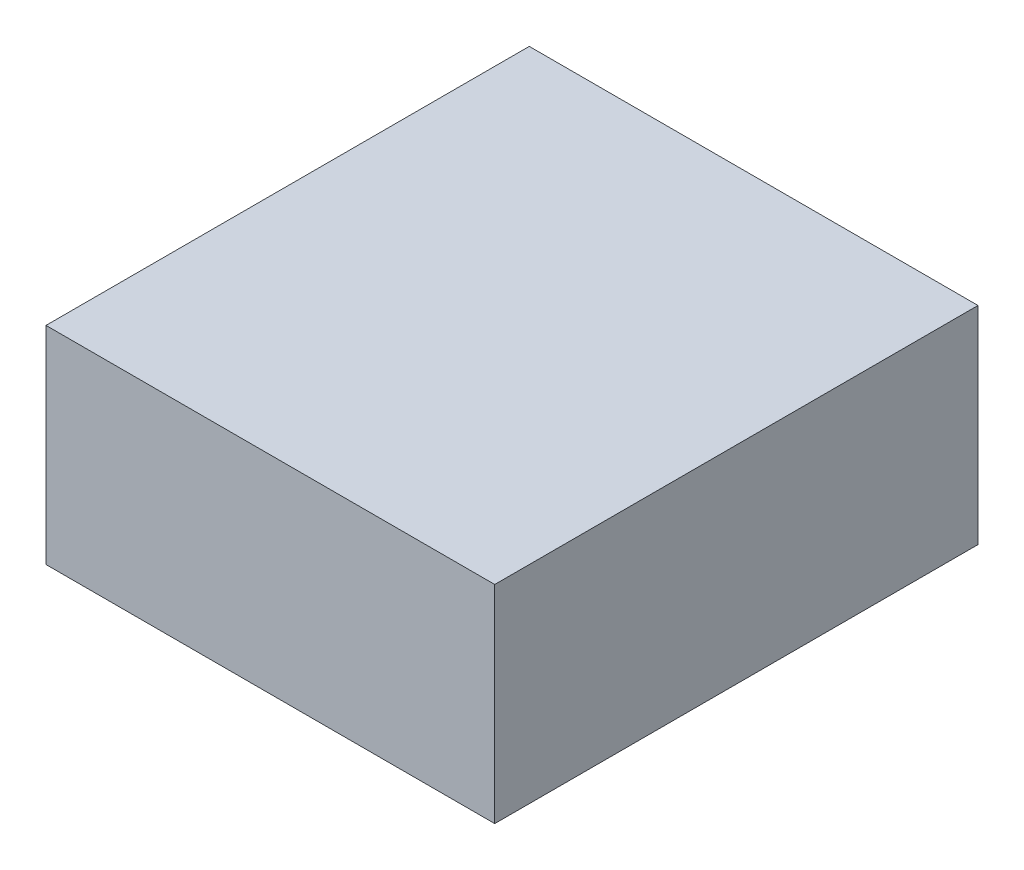
ISO-10303-21;
HEADER;
FILE_DESCRIPTION(('STEP AP214'),'2;1');
FILE_NAME('part.step','',(''),(''),'','','');
FILE_SCHEMA(('AUTOMOTIVE_DESIGN { 1 0 10303 214 1 1 1 1 }'));
ENDSEC;
DATA;
#1=APPLICATION_CONTEXT('core data for automotive mechanical design processes');
#2=APPLICATION_PROTOCOL_DEFINITION('international standard','automotive_design',2000,#1);
#3=PRODUCT_CONTEXT('',#1,'mechanical');
#4=PRODUCT('Part','Part','',(#3));
#5=PRODUCT_RELATED_PRODUCT_CATEGORY('part','',(#4));
#6=PRODUCT_DEFINITION_FORMATION('','',#4);
#7=PRODUCT_DEFINITION_CONTEXT('part definition',#1,'design');
#8=PRODUCT_DEFINITION('design','',#6,#7);
#9=PRODUCT_DEFINITION_SHAPE('','',#8);
#10=(LENGTH_UNIT() NAMED_UNIT(*) SI_UNIT(.MILLI.,.METRE.));
#11=(NAMED_UNIT(*) PLANE_ANGLE_UNIT() SI_UNIT($,.RADIAN.));
#12=(NAMED_UNIT(*) SI_UNIT($,.STERADIAN.) SOLID_ANGLE_UNIT());
#13=UNCERTAINTY_MEASURE_WITH_UNIT(LENGTH_MEASURE(1.E-05),#10,'distance_accuracy_value','');
#14=(GEOMETRIC_REPRESENTATION_CONTEXT(3) GLOBAL_UNCERTAINTY_ASSIGNED_CONTEXT((#13)) GLOBAL_UNIT_ASSIGNED_CONTEXT((#10,
#11,#12)) REPRESENTATION_CONTEXT('',''));
#15=CARTESIAN_POINT('',(0.,0.,0.));
#16=DIRECTION('',(0.,0.,1.));
#17=DIRECTION('',(1.,0.,0.));
#18=AXIS2_PLACEMENT_3D('',#15,#16,#17);
#19=CARTESIAN_POINT('',(0.,38.1,0.));
#20=DIRECTION('',(1.,0.,0.));
#21=DIRECTION('',(0.,0.,-1.));
#22=AXIS2_PLACEMENT_3D('',#19,#20,#21);
#23=PLANE('',#22);
#24=DIRECTION('',(0.,0.,1.));
#25=VECTOR('',#24,1.);
#26=CARTESIAN_POINT('',(0.,0.,0.));
#27=LINE('',#26,#25);
#28=CARTESIAN_POINT('',(0.,0.,-88.9));
#29=VERTEX_POINT('',#28);
#30=CARTESIAN_POINT('',(0.,0.,0.));
#31=VERTEX_POINT('',#30);
#32=EDGE_CURVE('E94',#29,#31,#27,.T.);
#33=ORIENTED_EDGE('',*,*,#32,.T.);
#34=DIRECTION('',(0.,-1.,0.));
#35=VECTOR('',#34,1.);
#36=CARTESIAN_POINT('',(0.,38.1,0.));
#37=LINE('',#36,#35);
#38=CARTESIAN_POINT('',(0.,38.1,0.));
#39=VERTEX_POINT('',#38);
#40=EDGE_CURVE('E11',#39,#31,#37,.T.);
#41=ORIENTED_EDGE('',*,*,#40,.F.);
#42=DIRECTION('',(0.,0.,1.));
#43=VECTOR('',#42,1.);
#44=CARTESIAN_POINT('',(0.,38.1,0.));
#45=LINE('',#44,#43);
#46=CARTESIAN_POINT('',(0.,38.1,-88.9));
#47=VERTEX_POINT('',#46);
#48=EDGE_CURVE('E82',#47,#39,#45,.T.);
#49=ORIENTED_EDGE('',*,*,#48,.F.);
#50=DIRECTION('',(0.,-1.,0.));
#51=VECTOR('',#50,1.);
#52=CARTESIAN_POINT('',(0.,38.1,-88.9));
#53=LINE('',#52,#51);
#54=EDGE_CURVE('E90',#47,#29,#53,.T.);
#55=ORIENTED_EDGE('',*,*,#54,.T.);
#56=EDGE_LOOP('',(#33,#41,#49,#55));
#57=FACE_BOUND('',#56,.T.);
#58=ADVANCED_FACE('F31',(#57),#23,.F.);
#59=CARTESIAN_POINT('',(0.,38.1,0.));
#60=DIRECTION('',(0.,0.,-1.));
#61=DIRECTION('',(-1.,0.,0.));
#62=AXIS2_PLACEMENT_3D('',#59,#60,#61);
#63=PLANE('',#62);
#64=DIRECTION('',(1.,0.,0.));
#65=VECTOR('',#64,1.);
#66=CARTESIAN_POINT('',(0.,0.,0.));
#67=LINE('',#66,#65);
#68=CARTESIAN_POINT('',(82.55,0.,0.));
#69=VERTEX_POINT('',#68);
#70=EDGE_CURVE('E86',#31,#69,#67,.T.);
#71=ORIENTED_EDGE('',*,*,#70,.T.);
#72=DIRECTION('',(0.,-1.,0.));
#73=VECTOR('',#72,1.);
#74=CARTESIAN_POINT('',(82.55,38.1,0.));
#75=LINE('',#74,#73);
#76=CARTESIAN_POINT('',(82.55,38.1,0.));
#77=VERTEX_POINT('',#76);
#78=EDGE_CURVE('E39',#77,#69,#75,.T.);
#79=ORIENTED_EDGE('',*,*,#78,.F.);
#80=DIRECTION('',(1.,0.,0.));
#81=VECTOR('',#80,1.);
#82=CARTESIAN_POINT('',(0.,38.1,0.));
#83=LINE('',#82,#81);
#84=EDGE_CURVE('E77',#39,#77,#83,.T.);
#85=ORIENTED_EDGE('',*,*,#84,.F.);
#86=ORIENTED_EDGE('',*,*,#40,.T.);
#87=EDGE_LOOP('',(#71,#79,#85,#86));
#88=FACE_BOUND('',#87,.T.);
#89=ADVANCED_FACE('F85',(#88),#63,.F.);
#90=CARTESIAN_POINT('',(82.55,38.1,0.));
#91=DIRECTION('',(-1.,0.,0.));
#92=DIRECTION('',(0.,0.,1.));
#93=AXIS2_PLACEMENT_3D('',#90,#91,#92);
#94=PLANE('',#93);
#95=DIRECTION('',(0.,0.,-1.));
#96=VECTOR('',#95,1.);
#97=CARTESIAN_POINT('',(82.55,0.,0.));
#98=LINE('',#97,#96);
#99=CARTESIAN_POINT('',(82.55,0.,-88.9));
#100=VERTEX_POINT('',#99);
#101=EDGE_CURVE('E64',#69,#100,#98,.T.);
#102=ORIENTED_EDGE('',*,*,#101,.T.);
#103=DIRECTION('',(0.,-1.,0.));
#104=VECTOR('',#103,1.);
#105=CARTESIAN_POINT('',(82.55,38.1,-88.9));
#106=LINE('',#105,#104);
#107=CARTESIAN_POINT('',(82.55,38.1,-88.9));
#108=VERTEX_POINT('',#107);
#109=EDGE_CURVE('E87',#108,#100,#106,.T.);
#110=ORIENTED_EDGE('',*,*,#109,.F.);
#111=DIRECTION('',(0.,0.,-1.));
#112=VECTOR('',#111,1.);
#113=CARTESIAN_POINT('',(82.55,38.1,0.));
#114=LINE('',#113,#112);
#115=EDGE_CURVE('E80',#77,#108,#114,.T.);
#116=ORIENTED_EDGE('',*,*,#115,.F.);
#117=ORIENTED_EDGE('',*,*,#78,.T.);
#118=EDGE_LOOP('',(#102,#110,#116,#117));
#119=FACE_BOUND('',#118,.T.);
#120=ADVANCED_FACE('F88',(#119),#94,.F.);
#121=CARTESIAN_POINT('',(0.,38.1,-88.9));
#122=DIRECTION('',(0.,0.,1.));
#123=DIRECTION('',(1.,0.,0.));
#124=AXIS2_PLACEMENT_3D('',#121,#122,#123);
#125=PLANE('',#124);
#126=DIRECTION('',(-1.,0.,0.));
#127=VECTOR('',#126,1.);
#128=CARTESIAN_POINT('',(0.,0.,-88.9));
#129=LINE('',#128,#127);
#130=EDGE_CURVE('E70',#100,#29,#129,.T.);
#131=ORIENTED_EDGE('',*,*,#130,.T.);
#132=ORIENTED_EDGE('',*,*,#54,.F.);
#133=DIRECTION('',(-1.,0.,0.));
#134=VECTOR('',#133,1.);
#135=CARTESIAN_POINT('',(0.,38.1,-88.9));
#136=LINE('',#135,#134);
#137=EDGE_CURVE('E47',#108,#47,#136,.T.);
#138=ORIENTED_EDGE('',*,*,#137,.F.);
#139=ORIENTED_EDGE('',*,*,#109,.T.);
#140=EDGE_LOOP('',(#131,#132,#138,#139));
#141=FACE_BOUND('',#140,.T.);
#142=ADVANCED_FACE('F101',(#141),#125,.F.);
#143=CARTESIAN_POINT('',(0.,38.1,-88.9));
#144=DIRECTION('',(0.,-1.,0.));
#145=DIRECTION('',(0.,0.,-1.));
#146=AXIS2_PLACEMENT_3D('',#143,#144,#145);
#147=PLANE('',#146);
#148=ORIENTED_EDGE('',*,*,#48,.T.);
#149=ORIENTED_EDGE('',*,*,#84,.T.);
#150=ORIENTED_EDGE('',*,*,#115,.T.);
#151=ORIENTED_EDGE('',*,*,#137,.T.);
#152=EDGE_LOOP('',(#148,#149,#150,#151));
#153=FACE_BOUND('',#152,.T.);
#154=ADVANCED_FACE('F78',(#153),#147,.F.);
#155=CARTESIAN_POINT('',(0.,0.,-88.9));
#156=DIRECTION('',(0.,-1.,0.));
#157=DIRECTION('',(0.,0.,-1.));
#158=AXIS2_PLACEMENT_3D('',#155,#156,#157);
#159=PLANE('',#158);
#160=ORIENTED_EDGE('',*,*,#32,.F.);
#161=ORIENTED_EDGE('',*,*,#130,.F.);
#162=ORIENTED_EDGE('',*,*,#101,.F.);
#163=ORIENTED_EDGE('',*,*,#70,.F.);
#164=EDGE_LOOP('',(#160,#161,#162,#163));
#165=FACE_BOUND('',#164,.T.);
#166=ADVANCED_FACE('F104',(#165),#159,.T.);
#167=CLOSED_SHELL('',(#58,#89,#120,#142,#154,#166));
#168=MANIFOLD_SOLID_BREP('B2',#167);
#169=ADVANCED_BREP_SHAPE_REPRESENTATION('',(#18,#168),#14);
#170=SHAPE_DEFINITION_REPRESENTATION(#9,#169);
ENDSEC;
END-ISO-10303-21;
